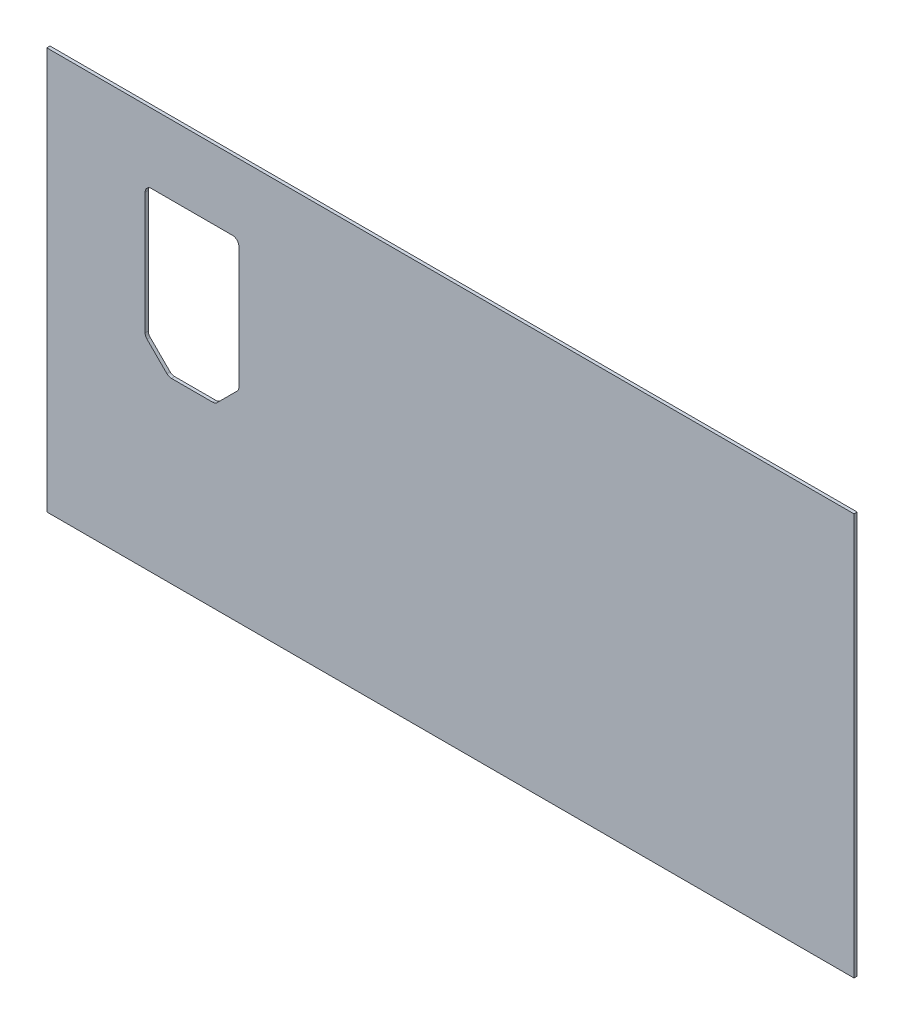
ISO-10303-21;
HEADER;
FILE_DESCRIPTION(('STEP AP214'),'2;1');
FILE_NAME('part.step','',(''),(''),'','','');
FILE_SCHEMA(('AUTOMOTIVE_DESIGN { 1 0 10303 214 1 1 1 1 }'));
ENDSEC;
DATA;
#1=APPLICATION_CONTEXT('core data for automotive mechanical design processes');
#2=APPLICATION_PROTOCOL_DEFINITION('international standard','automotive_design',2000,#1);
#3=PRODUCT_CONTEXT('',#1,'mechanical');
#4=PRODUCT('Part','Part','',(#3));
#5=PRODUCT_RELATED_PRODUCT_CATEGORY('part','',(#4));
#6=PRODUCT_DEFINITION_FORMATION('','',#4);
#7=PRODUCT_DEFINITION_CONTEXT('part definition',#1,'design');
#8=PRODUCT_DEFINITION('design','',#6,#7);
#9=PRODUCT_DEFINITION_SHAPE('','',#8);
#10=(LENGTH_UNIT() NAMED_UNIT(*) SI_UNIT(.MILLI.,.METRE.));
#11=(NAMED_UNIT(*) PLANE_ANGLE_UNIT() SI_UNIT($,.RADIAN.));
#12=(NAMED_UNIT(*) SI_UNIT($,.STERADIAN.) SOLID_ANGLE_UNIT());
#13=UNCERTAINTY_MEASURE_WITH_UNIT(LENGTH_MEASURE(1.E-05),#10,'distance_accuracy_value','');
#14=(GEOMETRIC_REPRESENTATION_CONTEXT(3) GLOBAL_UNCERTAINTY_ASSIGNED_CONTEXT((#13)) GLOBAL_UNIT_ASSIGNED_CONTEXT((#10,
#11,#12)) REPRESENTATION_CONTEXT('',''));
#15=CARTESIAN_POINT('',(0.,0.,0.));
#16=DIRECTION('',(0.,0.,1.));
#17=DIRECTION('',(1.,0.,0.));
#18=AXIS2_PLACEMENT_3D('',#15,#16,#17);
#19=CARTESIAN_POINT('',(126.5,63.,-1.));
#20=DIRECTION('',(1.,0.,0.));
#21=DIRECTION('',(0.,0.,-1.));
#22=AXIS2_PLACEMENT_3D('',#19,#20,#21);
#23=PLANE('',#22);
#24=DIRECTION('',(0.,1.,0.));
#25=VECTOR('',#24,1.);
#26=CARTESIAN_POINT('',(126.5,63.,0.));
#27=LINE('',#26,#25);
#28=CARTESIAN_POINT('',(126.5,-63.,0.));
#29=VERTEX_POINT('',#28);
#30=CARTESIAN_POINT('',(126.5,63.,0.));
#31=VERTEX_POINT('',#30);
#32=EDGE_CURVE('E232',#29,#31,#27,.T.);
#33=ORIENTED_EDGE('',*,*,#32,.F.);
#34=DIRECTION('',(0.,0.,1.));
#35=VECTOR('',#34,1.);
#36=CARTESIAN_POINT('',(126.5,-63.,-1.));
#37=LINE('',#36,#35);
#38=CARTESIAN_POINT('',(126.5,-63.,-1.));
#39=VERTEX_POINT('',#38);
#40=EDGE_CURVE('E11',#39,#29,#37,.T.);
#41=ORIENTED_EDGE('',*,*,#40,.F.);
#42=DIRECTION('',(0.,1.,0.));
#43=VECTOR('',#42,1.);
#44=CARTESIAN_POINT('',(126.5,63.,-1.));
#45=LINE('',#44,#43);
#46=CARTESIAN_POINT('',(126.5,63.,-1.));
#47=VERTEX_POINT('',#46);
#48=EDGE_CURVE('E251',#39,#47,#45,.T.);
#49=ORIENTED_EDGE('',*,*,#48,.T.);
#50=DIRECTION('',(0.,0.,1.));
#51=VECTOR('',#50,1.);
#52=CARTESIAN_POINT('',(126.5,63.,-1.));
#53=LINE('',#52,#51);
#54=EDGE_CURVE('E39',#47,#31,#53,.T.);
#55=ORIENTED_EDGE('',*,*,#54,.T.);
#56=EDGE_LOOP('',(#33,#41,#49,#55));
#57=FACE_BOUND('',#56,.T.);
#58=ADVANCED_FACE('F36',(#57),#23,.T.);
#59=CARTESIAN_POINT('',(-126.5,-63.,-1.));
#60=DIRECTION('',(0.,-1.,0.));
#61=DIRECTION('',(0.,0.,-1.));
#62=AXIS2_PLACEMENT_3D('',#59,#60,#61);
#63=PLANE('',#62);
#64=DIRECTION('',(1.,0.,0.));
#65=VECTOR('',#64,1.);
#66=CARTESIAN_POINT('',(-126.5,-63.,0.));
#67=LINE('',#66,#65);
#68=CARTESIAN_POINT('',(-126.5,-63.,0.));
#69=VERTEX_POINT('',#68);
#70=EDGE_CURVE('E255',#69,#29,#67,.T.);
#71=ORIENTED_EDGE('',*,*,#70,.F.);
#72=DIRECTION('',(0.,0.,1.));
#73=VECTOR('',#72,1.);
#74=CARTESIAN_POINT('',(-126.5,-63.,-1.));
#75=LINE('',#74,#73);
#76=CARTESIAN_POINT('',(-126.5,-63.,-1.));
#77=VERTEX_POINT('',#76);
#78=EDGE_CURVE('E44',#77,#69,#75,.T.);
#79=ORIENTED_EDGE('',*,*,#78,.F.);
#80=DIRECTION('',(1.,0.,0.));
#81=VECTOR('',#80,1.);
#82=CARTESIAN_POINT('',(-126.5,-63.,-1.));
#83=LINE('',#82,#81);
#84=EDGE_CURVE('E261',#77,#39,#83,.T.);
#85=ORIENTED_EDGE('',*,*,#84,.T.);
#86=ORIENTED_EDGE('',*,*,#40,.T.);
#87=EDGE_LOOP('',(#71,#79,#85,#86));
#88=FACE_BOUND('',#87,.T.);
#89=ADVANCED_FACE('F287',(#88),#63,.T.);
#90=CARTESIAN_POINT('',(-126.5,63.,-1.));
#91=DIRECTION('',(-1.,0.,0.));
#92=DIRECTION('',(0.,0.,1.));
#93=AXIS2_PLACEMENT_3D('',#90,#91,#92);
#94=PLANE('',#93);
#95=DIRECTION('',(0.,-1.,0.));
#96=VECTOR('',#95,1.);
#97=CARTESIAN_POINT('',(-126.5,63.,0.));
#98=LINE('',#97,#96);
#99=CARTESIAN_POINT('',(-126.5,63.,0.));
#100=VERTEX_POINT('',#99);
#101=EDGE_CURVE('E269',#100,#69,#98,.T.);
#102=ORIENTED_EDGE('',*,*,#101,.F.);
#103=DIRECTION('',(0.,0.,1.));
#104=VECTOR('',#103,1.);
#105=CARTESIAN_POINT('',(-126.5,63.,-1.));
#106=LINE('',#105,#104);
#107=CARTESIAN_POINT('',(-126.5,63.,-1.));
#108=VERTEX_POINT('',#107);
#109=EDGE_CURVE('E274',#108,#100,#106,.T.);
#110=ORIENTED_EDGE('',*,*,#109,.F.);
#111=DIRECTION('',(0.,-1.,0.));
#112=VECTOR('',#111,1.);
#113=CARTESIAN_POINT('',(-126.5,63.,-1.));
#114=LINE('',#113,#112);
#115=EDGE_CURVE('E258',#108,#77,#114,.T.);
#116=ORIENTED_EDGE('',*,*,#115,.T.);
#117=ORIENTED_EDGE('',*,*,#78,.T.);
#118=EDGE_LOOP('',(#102,#110,#116,#117));
#119=FACE_BOUND('',#118,.T.);
#120=ADVANCED_FACE('F291',(#119),#94,.T.);
#121=CARTESIAN_POINT('',(-126.5,63.,-1.));
#122=DIRECTION('',(0.,1.,0.));
#123=DIRECTION('',(0.,0.,1.));
#124=AXIS2_PLACEMENT_3D('',#121,#122,#123);
#125=PLANE('',#124);
#126=DIRECTION('',(-1.,0.,0.));
#127=VECTOR('',#126,1.);
#128=CARTESIAN_POINT('',(-126.5,63.,0.));
#129=LINE('',#128,#127);
#130=EDGE_CURVE('E266',#31,#100,#129,.T.);
#131=ORIENTED_EDGE('',*,*,#130,.F.);
#132=ORIENTED_EDGE('',*,*,#54,.F.);
#133=DIRECTION('',(-1.,0.,0.));
#134=VECTOR('',#133,1.);
#135=CARTESIAN_POINT('',(-126.5,63.,-1.));
#136=LINE('',#135,#134);
#137=EDGE_CURVE('E254',#47,#108,#136,.T.);
#138=ORIENTED_EDGE('',*,*,#137,.T.);
#139=ORIENTED_EDGE('',*,*,#109,.T.);
#140=EDGE_LOOP('',(#131,#132,#138,#139));
#141=FACE_BOUND('',#140,.T.);
#142=ADVANCED_FACE('F282',(#141),#125,.T.);
#143=CARTESIAN_POINT('',(0.,0.,-1.));
#144=DIRECTION('',(0.,0.,1.));
#145=DIRECTION('',(1.,0.,0.));
#146=AXIS2_PLACEMENT_3D('',#143,#144,#145);
#147=PLANE('',#146);
#148=DIRECTION('',(1.,0.,0.));
#149=VECTOR('',#148,1.);
#150=CARTESIAN_POINT('',(-80.9999999999996,-7.19999999999998,-1.));
#151=LINE('',#150,#149);
#152=CARTESIAN_POINT('',(-87.4615223689145,-7.19999999999998,-1.));
#153=VERTEX_POINT('',#152);
#154=CARTESIAN_POINT('',(-74.5384776310847,-7.19999999999998,-1.));
#155=VERTEX_POINT('',#154);
#156=EDGE_CURVE('E195',#153,#155,#151,.T.);
#157=ORIENTED_EDGE('',*,*,#156,.T.);
#158=CARTESIAN_POINT('',(-74.5384776310846,-5.19999999999998,-1.));
#159=DIRECTION('',(0.,0.,1.));
#160=DIRECTION('',(1.,0.,0.));
#161=AXIS2_PLACEMENT_3D('',#158,#159,#160);
#162=CIRCLE('',#161,2.);
#163=CARTESIAN_POINT('',(-73.1242640687116,-6.61421356237309,-1.));
#164=VERTEX_POINT('',#163);
#165=EDGE_CURVE('E197',#155,#164,#162,.T.);
#166=ORIENTED_EDGE('',*,*,#165,.T.);
#167=DIRECTION('',(0.70710678118655,0.707106781186545,0.));
#168=VECTOR('',#167,1.);
#169=CARTESIAN_POINT('',(-70.005025253169,-3.49497474683057,-1.));
#170=LINE('',#169,#168);
#171=CARTESIAN_POINT('',(-66.8857864376265,-0.37573593128809,-1.));
#172=VERTEX_POINT('',#171);
#173=EDGE_CURVE('E172',#164,#172,#170,.T.);
#174=ORIENTED_EDGE('',*,*,#173,.T.);
#175=CARTESIAN_POINT('',(-68.2999999999996,1.03847763108499,-1.));
#176=DIRECTION('',(0.,0.,1.));
#177=DIRECTION('',(-1.,0.,0.));
#178=AXIS2_PLACEMENT_3D('',#175,#176,#177);
#179=CIRCLE('',#178,2.);
#180=CARTESIAN_POINT('',(-66.2999999999996,1.03847763108501,-1.));
#181=VERTEX_POINT('',#180);
#182=EDGE_CURVE('E52',#172,#181,#179,.T.);
#183=ORIENTED_EDGE('',*,*,#182,.T.);
#184=DIRECTION('',(0.,1.,0.));
#185=VECTOR('',#184,1.);
#186=CARTESIAN_POINT('',(-66.2999999999996,39.2,-1.));
#187=LINE('',#186,#185);
#188=CARTESIAN_POINT('',(-66.2999999999996,39.2,-1.));
#189=VERTEX_POINT('',#188);
#190=EDGE_CURVE('E159',#181,#189,#187,.T.);
#191=ORIENTED_EDGE('',*,*,#190,.T.);
#192=CARTESIAN_POINT('',(-68.2999999999996,39.2,-1.));
#193=DIRECTION('',(0.,0.,1.));
#194=DIRECTION('',(-1.,0.,0.));
#195=AXIS2_PLACEMENT_3D('',#192,#193,#194);
#196=CIRCLE('',#195,2.);
#197=CARTESIAN_POINT('',(-68.2999999999996,41.2,-1.));
#198=VERTEX_POINT('',#197);
#199=EDGE_CURVE('E164',#189,#198,#196,.T.);
#200=ORIENTED_EDGE('',*,*,#199,.T.);
#201=DIRECTION('',(-1.,0.,0.));
#202=VECTOR('',#201,1.);
#203=CARTESIAN_POINT('',(-93.6999999999996,41.2,-1.));
#204=LINE('',#203,#202);
#205=CARTESIAN_POINT('',(-93.6999999999996,41.2,-1.));
#206=VERTEX_POINT('',#205);
#207=EDGE_CURVE('E177',#198,#206,#204,.T.);
#208=ORIENTED_EDGE('',*,*,#207,.T.);
#209=CARTESIAN_POINT('',(-93.6999999999996,39.2,-1.));
#210=DIRECTION('',(0.,0.,1.));
#211=DIRECTION('',(-1.,0.,0.));
#212=AXIS2_PLACEMENT_3D('',#209,#210,#211);
#213=CIRCLE('',#212,2.);
#214=CARTESIAN_POINT('',(-95.6999999999996,39.2,-1.));
#215=VERTEX_POINT('',#214);
#216=EDGE_CURVE('E180',#206,#215,#213,.T.);
#217=ORIENTED_EDGE('',*,*,#216,.T.);
#218=DIRECTION('',(0.,-1.,0.));
#219=VECTOR('',#218,1.);
#220=CARTESIAN_POINT('',(-95.6999999999996,19.75,-1.));
#221=LINE('',#220,#219);
#222=CARTESIAN_POINT('',(-95.6999999999996,1.03847763108502,-1.));
#223=VERTEX_POINT('',#222);
#224=EDGE_CURVE('E183',#215,#223,#221,.T.);
#225=ORIENTED_EDGE('',*,*,#224,.T.);
#226=CARTESIAN_POINT('',(-93.6999999999996,1.03847763108501,-1.));
#227=DIRECTION('',(0.,0.,1.));
#228=DIRECTION('',(-1.,0.,0.));
#229=AXIS2_PLACEMENT_3D('',#226,#227,#228);
#230=CIRCLE('',#229,2.);
#231=CARTESIAN_POINT('',(-95.1142135623727,-0.375735931288093,-1.));
#232=VERTEX_POINT('',#231);
#233=EDGE_CURVE('E186',#223,#232,#230,.T.);
#234=ORIENTED_EDGE('',*,*,#233,.T.);
#235=DIRECTION('',(0.707106781186553,-0.707106781186542,0.));
#236=VECTOR('',#235,1.);
#237=CARTESIAN_POINT('',(-94.0649419784595,-1.42500751520128,-1.));
#238=LINE('',#237,#236);
#239=CARTESIAN_POINT('',(-88.8757359312876,-6.61421356237308,-1.));
#240=VERTEX_POINT('',#239);
#241=EDGE_CURVE('E189',#232,#240,#238,.T.);
#242=ORIENTED_EDGE('',*,*,#241,.T.);
#243=CARTESIAN_POINT('',(-87.4615223689146,-5.19999999999998,-1.));
#244=DIRECTION('',(0.,0.,1.));
#245=DIRECTION('',(1.,0.,0.));
#246=AXIS2_PLACEMENT_3D('',#243,#244,#245);
#247=CIRCLE('',#246,2.);
#248=EDGE_CURVE('E192',#240,#153,#247,.T.);
#249=ORIENTED_EDGE('',*,*,#248,.T.);
#250=EDGE_LOOP('',(#157,#166,#174,#183,#191,#200,#208,#217,#225,#234,#242,#249));
#251=FACE_BOUND('',#250,.T.);
#252=ORIENTED_EDGE('',*,*,#48,.F.);
#253=ORIENTED_EDGE('',*,*,#84,.F.);
#254=ORIENTED_EDGE('',*,*,#115,.F.);
#255=ORIENTED_EDGE('',*,*,#137,.F.);
#256=EDGE_LOOP('',(#252,#253,#254,#255));
#257=FACE_BOUND('',#256,.T.);
#258=ADVANCED_FACE('F168',(#251,#257),#147,.F.);
#259=CARTESIAN_POINT('',(0.,0.,0.));
#260=DIRECTION('',(0.,0.,1.));
#261=DIRECTION('',(1.,0.,0.));
#262=AXIS2_PLACEMENT_3D('',#259,#260,#261);
#263=PLANE('',#262);
#264=CARTESIAN_POINT('',(-74.5384776310846,-5.19999999999998,0.));
#265=DIRECTION('',(0.,0.,1.));
#266=DIRECTION('',(1.,0.,0.));
#267=AXIS2_PLACEMENT_3D('',#264,#265,#266);
#268=CIRCLE('',#267,2.);
#269=CARTESIAN_POINT('',(-74.5384776310847,-7.19999999999998,0.));
#270=VERTEX_POINT('',#269);
#271=CARTESIAN_POINT('',(-73.1242640687116,-6.61421356237309,0.));
#272=VERTEX_POINT('',#271);
#273=EDGE_CURVE('E60',#270,#272,#268,.T.);
#274=ORIENTED_EDGE('',*,*,#273,.F.);
#275=DIRECTION('',(1.,0.,0.));
#276=VECTOR('',#275,1.);
#277=CARTESIAN_POINT('',(-80.9999999999996,-7.19999999999998,0.));
#278=LINE('',#277,#276);
#279=CARTESIAN_POINT('',(-87.4615223689145,-7.19999999999998,0.));
#280=VERTEX_POINT('',#279);
#281=EDGE_CURVE('E226',#280,#270,#278,.T.);
#282=ORIENTED_EDGE('',*,*,#281,.F.);
#283=CARTESIAN_POINT('',(-87.4615223689146,-5.19999999999998,0.));
#284=DIRECTION('',(0.,0.,1.));
#285=DIRECTION('',(1.,0.,0.));
#286=AXIS2_PLACEMENT_3D('',#283,#284,#285);
#287=CIRCLE('',#286,2.);
#288=CARTESIAN_POINT('',(-88.8757359312876,-6.61421356237308,0.));
#289=VERTEX_POINT('',#288);
#290=EDGE_CURVE('E223',#289,#280,#287,.T.);
#291=ORIENTED_EDGE('',*,*,#290,.F.);
#292=DIRECTION('',(0.70710678118655,-0.707106781186545,0.));
#293=VECTOR('',#292,1.);
#294=CARTESIAN_POINT('',(-91.9949747468302,-3.49497474683057,0.));
#295=LINE('',#294,#293);
#296=CARTESIAN_POINT('',(-95.1142135623727,-0.375735931288093,0.));
#297=VERTEX_POINT('',#296);
#298=EDGE_CURVE('E220',#297,#289,#295,.T.);
#299=ORIENTED_EDGE('',*,*,#298,.F.);
#300=CARTESIAN_POINT('',(-93.6999999999996,1.03847763108501,0.));
#301=DIRECTION('',(0.,0.,1.));
#302=DIRECTION('',(-1.,0.,0.));
#303=AXIS2_PLACEMENT_3D('',#300,#301,#302);
#304=CIRCLE('',#303,2.);
#305=CARTESIAN_POINT('',(-95.6999999999996,1.03847763108502,0.));
#306=VERTEX_POINT('',#305);
#307=EDGE_CURVE('E217',#306,#297,#304,.T.);
#308=ORIENTED_EDGE('',*,*,#307,.F.);
#309=DIRECTION('',(0.,-1.,0.));
#310=VECTOR('',#309,1.);
#311=CARTESIAN_POINT('',(-95.6999999999996,19.75,0.));
#312=LINE('',#311,#310);
#313=CARTESIAN_POINT('',(-95.6999999999996,39.2,0.));
#314=VERTEX_POINT('',#313);
#315=EDGE_CURVE('E214',#314,#306,#312,.T.);
#316=ORIENTED_EDGE('',*,*,#315,.F.);
#317=CARTESIAN_POINT('',(-93.6999999999996,39.2,0.));
#318=DIRECTION('',(0.,0.,1.));
#319=DIRECTION('',(-1.,0.,0.));
#320=AXIS2_PLACEMENT_3D('',#317,#318,#319);
#321=CIRCLE('',#320,2.);
#322=CARTESIAN_POINT('',(-93.6999999999996,41.2,0.));
#323=VERTEX_POINT('',#322);
#324=EDGE_CURVE('E211',#323,#314,#321,.T.);
#325=ORIENTED_EDGE('',*,*,#324,.F.);
#326=DIRECTION('',(-1.,0.,0.));
#327=VECTOR('',#326,1.);
#328=CARTESIAN_POINT('',(-93.6999999999996,41.2,0.));
#329=LINE('',#328,#327);
#330=CARTESIAN_POINT('',(-68.2999999999996,41.2,0.));
#331=VERTEX_POINT('',#330);
#332=EDGE_CURVE('E208',#331,#323,#329,.T.);
#333=ORIENTED_EDGE('',*,*,#332,.F.);
#334=CARTESIAN_POINT('',(-68.2999999999996,39.2,0.));
#335=DIRECTION('',(0.,0.,1.));
#336=DIRECTION('',(-1.,0.,0.));
#337=AXIS2_PLACEMENT_3D('',#334,#335,#336);
#338=CIRCLE('',#337,2.);
#339=CARTESIAN_POINT('',(-66.2999999999996,39.2,0.));
#340=VERTEX_POINT('',#339);
#341=EDGE_CURVE('E205',#340,#331,#338,.T.);
#342=ORIENTED_EDGE('',*,*,#341,.F.);
#343=DIRECTION('',(0.,1.,0.));
#344=VECTOR('',#343,1.);
#345=CARTESIAN_POINT('',(-66.2999999999996,39.2,0.));
#346=LINE('',#345,#344);
#347=CARTESIAN_POINT('',(-66.2999999999996,1.03847763108501,0.));
#348=VERTEX_POINT('',#347);
#349=EDGE_CURVE('E203',#348,#340,#346,.T.);
#350=ORIENTED_EDGE('',*,*,#349,.F.);
#351=CARTESIAN_POINT('',(-68.2999999999996,1.03847763108499,0.));
#352=DIRECTION('',(0.,0.,1.));
#353=DIRECTION('',(-1.,0.,0.));
#354=AXIS2_PLACEMENT_3D('',#351,#352,#353);
#355=CIRCLE('',#354,2.);
#356=CARTESIAN_POINT('',(-66.8857864376265,-0.375735931288092,0.));
#357=VERTEX_POINT('',#356);
#358=EDGE_CURVE('E151',#357,#348,#355,.T.);
#359=ORIENTED_EDGE('',*,*,#358,.F.);
#360=DIRECTION('',(0.707106781186551,0.707106781186544,0.));
#361=VECTOR('',#360,1.);
#362=CARTESIAN_POINT('',(-70.005025253169,-3.49497474683057,0.));
#363=LINE('',#362,#361);
#364=EDGE_CURVE('E199',#272,#357,#363,.T.);
#365=ORIENTED_EDGE('',*,*,#364,.F.);
#366=EDGE_LOOP('',(#274,#282,#291,#299,#308,#316,#325,#333,#342,#350,#359,#365));
#367=FACE_BOUND('',#366,.T.);
#368=ORIENTED_EDGE('',*,*,#32,.T.);
#369=ORIENTED_EDGE('',*,*,#130,.T.);
#370=ORIENTED_EDGE('',*,*,#101,.T.);
#371=ORIENTED_EDGE('',*,*,#70,.T.);
#372=EDGE_LOOP('',(#368,#369,#370,#371));
#373=FACE_BOUND('',#372,.T.);
#374=ADVANCED_FACE('F284',(#367,#373),#263,.T.);
#375=CARTESIAN_POINT('',(-74.5384776310846,-5.19999999999998,-1.));
#376=DIRECTION('',(0.,0.,1.));
#377=DIRECTION('',(1.,0.,0.));
#378=AXIS2_PLACEMENT_3D('',#375,#376,#377);
#379=CYLINDRICAL_SURFACE('',#378,2.);
#380=ORIENTED_EDGE('',*,*,#273,.T.);
#381=DIRECTION('',(0.,0.,1.));
#382=VECTOR('',#381,1.);
#383=CARTESIAN_POINT('',(-73.1242640687116,-6.61421356237309,-1.));
#384=LINE('',#383,#382);
#385=EDGE_CURVE('E230',#164,#272,#384,.T.);
#386=ORIENTED_EDGE('',*,*,#385,.F.);
#387=ORIENTED_EDGE('',*,*,#165,.F.);
#388=DIRECTION('',(0.,0.,1.));
#389=VECTOR('',#388,1.);
#390=CARTESIAN_POINT('',(-74.5384776310847,-7.19999999999998,-1.));
#391=LINE('',#390,#389);
#392=EDGE_CURVE('E233',#155,#270,#391,.T.);
#393=ORIENTED_EDGE('',*,*,#392,.T.);
#394=EDGE_LOOP('',(#380,#386,#387,#393));
#395=FACE_BOUND('',#394,.T.);
#396=ADVANCED_FACE('F337',(#395),#379,.F.);
#397=CARTESIAN_POINT('',(-80.9999999999996,-7.19999999999998,-1.));
#398=DIRECTION('',(0.,-1.,0.));
#399=DIRECTION('',(1.,0.,0.));
#400=AXIS2_PLACEMENT_3D('',#397,#398,#399);
#401=PLANE('',#400);
#402=ORIENTED_EDGE('',*,*,#281,.T.);
#403=ORIENTED_EDGE('',*,*,#392,.F.);
#404=ORIENTED_EDGE('',*,*,#156,.F.);
#405=DIRECTION('',(0.,0.,1.));
#406=VECTOR('',#405,1.);
#407=CARTESIAN_POINT('',(-87.4615223689145,-7.19999999999998,-1.));
#408=LINE('',#407,#406);
#409=EDGE_CURVE('E235',#153,#280,#408,.T.);
#410=ORIENTED_EDGE('',*,*,#409,.T.);
#411=EDGE_LOOP('',(#402,#403,#404,#410));
#412=FACE_BOUND('',#411,.T.);
#413=ADVANCED_FACE('F348',(#412),#401,.F.);
#414=CARTESIAN_POINT('',(-87.4615223689146,-5.19999999999998,-1.));
#415=DIRECTION('',(0.,0.,1.));
#416=DIRECTION('',(1.,0.,0.));
#417=AXIS2_PLACEMENT_3D('',#414,#415,#416);
#418=CYLINDRICAL_SURFACE('',#417,2.);
#419=ORIENTED_EDGE('',*,*,#290,.T.);
#420=ORIENTED_EDGE('',*,*,#409,.F.);
#421=ORIENTED_EDGE('',*,*,#248,.F.);
#422=DIRECTION('',(0.,0.,1.));
#423=VECTOR('',#422,1.);
#424=CARTESIAN_POINT('',(-88.8757359312876,-6.61421356237308,-1.));
#425=LINE('',#424,#423);
#426=EDGE_CURVE('E237',#240,#289,#425,.T.);
#427=ORIENTED_EDGE('',*,*,#426,.T.);
#428=EDGE_LOOP('',(#419,#420,#421,#427));
#429=FACE_BOUND('',#428,.T.);
#430=ADVANCED_FACE('F359',(#429),#418,.F.);
#431=CARTESIAN_POINT('',(-91.9949747468302,-3.49497474683057,-1.));
#432=DIRECTION('',(-0.707106781186545,-0.70710678118655,0.));
#433=DIRECTION('',(0.70710678118655,-0.707106781186545,0.));
#434=AXIS2_PLACEMENT_3D('',#431,#432,#433);
#435=PLANE('',#434);
#436=ORIENTED_EDGE('',*,*,#298,.T.);
#437=ORIENTED_EDGE('',*,*,#426,.F.);
#438=ORIENTED_EDGE('',*,*,#241,.F.);
#439=DIRECTION('',(0.,0.,1.));
#440=VECTOR('',#439,1.);
#441=CARTESIAN_POINT('',(-95.1142135623727,-0.375735931288093,-1.));
#442=LINE('',#441,#440);
#443=EDGE_CURVE('E239',#232,#297,#442,.T.);
#444=ORIENTED_EDGE('',*,*,#443,.T.);
#445=EDGE_LOOP('',(#436,#437,#438,#444));
#446=FACE_BOUND('',#445,.T.);
#447=ADVANCED_FACE('F369',(#446),#435,.F.);
#448=CARTESIAN_POINT('',(-93.6999999999996,1.03847763108501,-1.));
#449=DIRECTION('',(0.,0.,1.));
#450=DIRECTION('',(1.,0.,0.));
#451=AXIS2_PLACEMENT_3D('',#448,#449,#450);
#452=CYLINDRICAL_SURFACE('',#451,2.);
#453=ORIENTED_EDGE('',*,*,#307,.T.);
#454=ORIENTED_EDGE('',*,*,#443,.F.);
#455=ORIENTED_EDGE('',*,*,#233,.F.);
#456=DIRECTION('',(0.,0.,1.));
#457=VECTOR('',#456,1.);
#458=CARTESIAN_POINT('',(-95.6999999999996,1.03847763108502,-1.));
#459=LINE('',#458,#457);
#460=EDGE_CURVE('E241',#223,#306,#459,.T.);
#461=ORIENTED_EDGE('',*,*,#460,.T.);
#462=EDGE_LOOP('',(#453,#454,#455,#461));
#463=FACE_BOUND('',#462,.T.);
#464=ADVANCED_FACE('F381',(#463),#452,.F.);
#465=CARTESIAN_POINT('',(-95.6999999999996,19.75,-1.));
#466=DIRECTION('',(-1.,0.,0.));
#467=DIRECTION('',(0.,0.,1.));
#468=AXIS2_PLACEMENT_3D('',#465,#466,#467);
#469=PLANE('',#468);
#470=ORIENTED_EDGE('',*,*,#315,.T.);
#471=ORIENTED_EDGE('',*,*,#460,.F.);
#472=ORIENTED_EDGE('',*,*,#224,.F.);
#473=DIRECTION('',(0.,0.,1.));
#474=VECTOR('',#473,1.);
#475=CARTESIAN_POINT('',(-95.6999999999996,39.2,-1.));
#476=LINE('',#475,#474);
#477=EDGE_CURVE('E243',#215,#314,#476,.T.);
#478=ORIENTED_EDGE('',*,*,#477,.T.);
#479=EDGE_LOOP('',(#470,#471,#472,#478));
#480=FACE_BOUND('',#479,.T.);
#481=ADVANCED_FACE('F392',(#480),#469,.F.);
#482=CARTESIAN_POINT('',(-93.6999999999996,39.2,-1.));
#483=DIRECTION('',(0.,0.,1.));
#484=DIRECTION('',(1.,0.,0.));
#485=AXIS2_PLACEMENT_3D('',#482,#483,#484);
#486=CYLINDRICAL_SURFACE('',#485,2.);
#487=ORIENTED_EDGE('',*,*,#324,.T.);
#488=ORIENTED_EDGE('',*,*,#477,.F.);
#489=ORIENTED_EDGE('',*,*,#216,.F.);
#490=DIRECTION('',(0.,0.,1.));
#491=VECTOR('',#490,1.);
#492=CARTESIAN_POINT('',(-93.6999999999996,41.2,-1.));
#493=LINE('',#492,#491);
#494=EDGE_CURVE('E245',#206,#323,#493,.T.);
#495=ORIENTED_EDGE('',*,*,#494,.T.);
#496=EDGE_LOOP('',(#487,#488,#489,#495));
#497=FACE_BOUND('',#496,.T.);
#498=ADVANCED_FACE('F404',(#497),#486,.F.);
#499=CARTESIAN_POINT('',(-93.6999999999996,41.2,-1.));
#500=DIRECTION('',(0.,1.,0.));
#501=DIRECTION('',(0.,0.,1.));
#502=AXIS2_PLACEMENT_3D('',#499,#500,#501);
#503=PLANE('',#502);
#504=ORIENTED_EDGE('',*,*,#332,.T.);
#505=ORIENTED_EDGE('',*,*,#494,.F.);
#506=ORIENTED_EDGE('',*,*,#207,.F.);
#507=DIRECTION('',(0.,0.,1.));
#508=VECTOR('',#507,1.);
#509=CARTESIAN_POINT('',(-68.2999999999996,41.2,-1.));
#510=LINE('',#509,#508);
#511=EDGE_CURVE('E247',#198,#331,#510,.T.);
#512=ORIENTED_EDGE('',*,*,#511,.T.);
#513=EDGE_LOOP('',(#504,#505,#506,#512));
#514=FACE_BOUND('',#513,.T.);
#515=ADVANCED_FACE('F414',(#514),#503,.F.);
#516=CARTESIAN_POINT('',(-68.2999999999996,39.2,-1.));
#517=DIRECTION('',(0.,0.,1.));
#518=DIRECTION('',(1.,0.,0.));
#519=AXIS2_PLACEMENT_3D('',#516,#517,#518);
#520=CYLINDRICAL_SURFACE('',#519,2.);
#521=ORIENTED_EDGE('',*,*,#341,.T.);
#522=ORIENTED_EDGE('',*,*,#511,.F.);
#523=ORIENTED_EDGE('',*,*,#199,.F.);
#524=DIRECTION('',(0.,0.,1.));
#525=VECTOR('',#524,1.);
#526=CARTESIAN_POINT('',(-66.2999999999996,39.2,-1.));
#527=LINE('',#526,#525);
#528=EDGE_CURVE('E155',#189,#340,#527,.T.);
#529=ORIENTED_EDGE('',*,*,#528,.T.);
#530=EDGE_LOOP('',(#521,#522,#523,#529));
#531=FACE_BOUND('',#530,.T.);
#532=ADVANCED_FACE('F425',(#531),#520,.F.);
#533=CARTESIAN_POINT('',(-66.2999999999996,39.2,-1.));
#534=DIRECTION('',(1.,0.,0.));
#535=DIRECTION('',(0.,0.,-1.));
#536=AXIS2_PLACEMENT_3D('',#533,#534,#535);
#537=PLANE('',#536);
#538=ORIENTED_EDGE('',*,*,#349,.T.);
#539=ORIENTED_EDGE('',*,*,#528,.F.);
#540=ORIENTED_EDGE('',*,*,#190,.F.);
#541=DIRECTION('',(0.,0.,1.));
#542=VECTOR('',#541,1.);
#543=CARTESIAN_POINT('',(-66.2999999999996,1.03847763108501,-1.));
#544=LINE('',#543,#542);
#545=EDGE_CURVE('E147',#181,#348,#544,.T.);
#546=ORIENTED_EDGE('',*,*,#545,.T.);
#547=EDGE_LOOP('',(#538,#539,#540,#546));
#548=FACE_BOUND('',#547,.T.);
#549=ADVANCED_FACE('F160',(#548),#537,.F.);
#550=CARTESIAN_POINT('',(-68.2999999999996,1.03847763108499,-1.));
#551=DIRECTION('',(0.,0.,1.));
#552=DIRECTION('',(1.,0.,0.));
#553=AXIS2_PLACEMENT_3D('',#550,#551,#552);
#554=CYLINDRICAL_SURFACE('',#553,2.);
#555=ORIENTED_EDGE('',*,*,#358,.T.);
#556=ORIENTED_EDGE('',*,*,#545,.F.);
#557=ORIENTED_EDGE('',*,*,#182,.F.);
#558=DIRECTION('',(0.,0.,1.));
#559=VECTOR('',#558,1.);
#560=CARTESIAN_POINT('',(-66.8857864376265,-0.375735931288092,-1.));
#561=LINE('',#560,#559);
#562=EDGE_CURVE('E156',#172,#357,#561,.T.);
#563=ORIENTED_EDGE('',*,*,#562,.T.);
#564=EDGE_LOOP('',(#555,#556,#557,#563));
#565=FACE_BOUND('',#564,.T.);
#566=ADVANCED_FACE('F149',(#565),#554,.F.);
#567=CARTESIAN_POINT('',(-70.005025253169,-3.49497474683057,-1.));
#568=DIRECTION('',(0.707106781186544,-0.707106781186551,0.));
#569=DIRECTION('',(0.707106781186551,0.707106781186544,0.));
#570=AXIS2_PLACEMENT_3D('',#567,#568,#569);
#571=PLANE('',#570);
#572=ORIENTED_EDGE('',*,*,#364,.T.);
#573=ORIENTED_EDGE('',*,*,#562,.F.);
#574=ORIENTED_EDGE('',*,*,#173,.F.);
#575=ORIENTED_EDGE('',*,*,#385,.T.);
#576=EDGE_LOOP('',(#572,#573,#574,#575));
#577=FACE_BOUND('',#576,.T.);
#578=ADVANCED_FACE('F455',(#577),#571,.F.);
#579=CLOSED_SHELL('',(#58,#89,#120,#142,#258,#374,#396,#413,#430,#447,#464,#481,#498,#515,#532,
#549,#566,#578));
#580=MANIFOLD_SOLID_BREP('B2',#579);
#581=ADVANCED_BREP_SHAPE_REPRESENTATION('',(#18,#580),#14);
#582=SHAPE_DEFINITION_REPRESENTATION(#9,#581);
ENDSEC;
END-ISO-10303-21;
